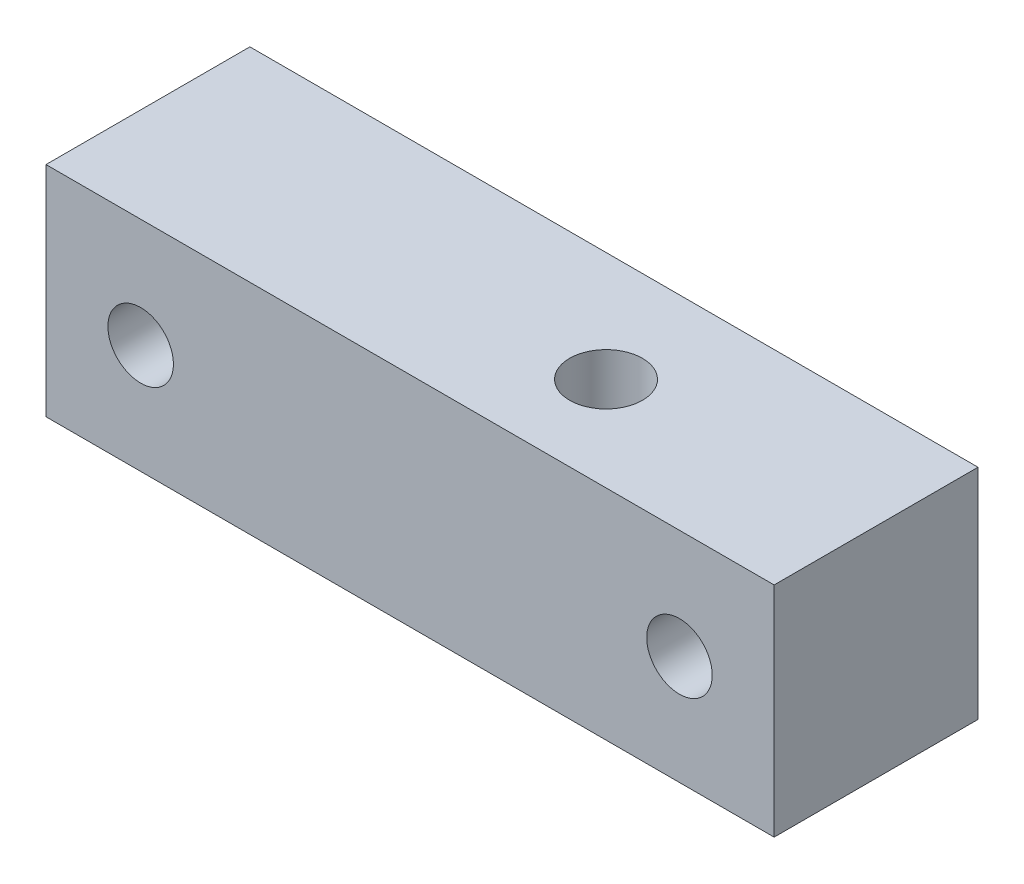
ISO-10303-21;
HEADER;
FILE_DESCRIPTION(('STEP AP214'),'2;1');
FILE_NAME('part.step','',(''),(''),'','','');
FILE_SCHEMA(('AUTOMOTIVE_DESIGN { 1 0 10303 214 1 1 1 1 }'));
ENDSEC;
DATA;
#1=APPLICATION_CONTEXT('core data for automotive mechanical design processes');
#2=APPLICATION_PROTOCOL_DEFINITION('international standard','automotive_design',2000,#1);
#3=PRODUCT_CONTEXT('',#1,'mechanical');
#4=PRODUCT('Part','Part','',(#3));
#5=PRODUCT_RELATED_PRODUCT_CATEGORY('part','',(#4));
#6=PRODUCT_DEFINITION_FORMATION('','',#4);
#7=PRODUCT_DEFINITION_CONTEXT('part definition',#1,'design');
#8=PRODUCT_DEFINITION('design','',#6,#7);
#9=PRODUCT_DEFINITION_SHAPE('','',#8);
#10=(LENGTH_UNIT() NAMED_UNIT(*) SI_UNIT(.MILLI.,.METRE.));
#11=(NAMED_UNIT(*) PLANE_ANGLE_UNIT() SI_UNIT($,.RADIAN.));
#12=(NAMED_UNIT(*) SI_UNIT($,.STERADIAN.) SOLID_ANGLE_UNIT());
#13=UNCERTAINTY_MEASURE_WITH_UNIT(LENGTH_MEASURE(1.E-05),#10,'distance_accuracy_value','');
#14=(GEOMETRIC_REPRESENTATION_CONTEXT(3) GLOBAL_UNCERTAINTY_ASSIGNED_CONTEXT((#13)) GLOBAL_UNIT_ASSIGNED_CONTEXT((#10,
#11,#12)) REPRESENTATION_CONTEXT('',''));
#15=CARTESIAN_POINT('',(0.,0.,0.));
#16=DIRECTION('',(0.,0.,1.));
#17=DIRECTION('',(1.,0.,0.));
#18=AXIS2_PLACEMENT_3D('',#15,#16,#17);
#19=CARTESIAN_POINT('',(0.,15.,14.));
#20=DIRECTION('',(1.,0.,0.));
#21=DIRECTION('',(0.,0.,-1.));
#22=AXIS2_PLACEMENT_3D('',#19,#20,#21);
#23=PLANE('',#22);
#24=DIRECTION('',(0.,-1.,0.));
#25=VECTOR('',#24,1.);
#26=CARTESIAN_POINT('',(0.,15.,0.));
#27=LINE('',#26,#25);
#28=CARTESIAN_POINT('',(0.,15.,0.));
#29=VERTEX_POINT('',#28);
#30=CARTESIAN_POINT('',(0.,0.,0.));
#31=VERTEX_POINT('',#30);
#32=EDGE_CURVE('E96',#29,#31,#27,.T.);
#33=ORIENTED_EDGE('',*,*,#32,.T.);
#34=DIRECTION('',(0.,0.,-1.));
#35=VECTOR('',#34,1.);
#36=CARTESIAN_POINT('',(0.,0.,14.));
#37=LINE('',#36,#35);
#38=CARTESIAN_POINT('',(0.,0.,14.));
#39=VERTEX_POINT('',#38);
#40=EDGE_CURVE('E11',#39,#31,#37,.T.);
#41=ORIENTED_EDGE('',*,*,#40,.F.);
#42=DIRECTION('',(0.,-1.,0.));
#43=VECTOR('',#42,1.);
#44=CARTESIAN_POINT('',(0.,15.,14.));
#45=LINE('',#44,#43);
#46=CARTESIAN_POINT('',(0.,15.,14.));
#47=VERTEX_POINT('',#46);
#48=EDGE_CURVE('E84',#47,#39,#45,.T.);
#49=ORIENTED_EDGE('',*,*,#48,.F.);
#50=DIRECTION('',(0.,0.,-1.));
#51=VECTOR('',#50,1.);
#52=CARTESIAN_POINT('',(0.,15.,14.));
#53=LINE('',#52,#51);
#54=EDGE_CURVE('E92',#47,#29,#53,.T.);
#55=ORIENTED_EDGE('',*,*,#54,.T.);
#56=EDGE_LOOP('',(#33,#41,#49,#55));
#57=FACE_BOUND('',#56,.T.);
#58=ADVANCED_FACE('F33',(#57),#23,.F.);
#59=CARTESIAN_POINT('',(0.,0.,14.));
#60=DIRECTION('',(0.,1.,0.));
#61=DIRECTION('',(0.,0.,1.));
#62=AXIS2_PLACEMENT_3D('',#59,#60,#61);
#63=PLANE('',#62);
#64=CARTESIAN_POINT('',(32.,0.,7.54199160164415));
#65=DIRECTION('',(0.,1.,0.));
#66=DIRECTION('',(-1.,0.,0.));
#67=AXIS2_PLACEMENT_3D('',#64,#65,#66);
#68=CIRCLE('',#67,2.5);
#69=CARTESIAN_POINT('',(29.5,0.,7.54199160164415));
#70=VERTEX_POINT('',#69);
#71=EDGE_CURVE('E99',#70,#70,#68,.T.);
#72=ORIENTED_EDGE('',*,*,#71,.T.);
#73=EDGE_LOOP('',(#72));
#74=FACE_BOUND('',#73,.T.);
#75=DIRECTION('',(1.,0.,0.));
#76=VECTOR('',#75,1.);
#77=CARTESIAN_POINT('',(0.,0.,0.));
#78=LINE('',#77,#76);
#79=CARTESIAN_POINT('',(50.,0.,0.));
#80=VERTEX_POINT('',#79);
#81=EDGE_CURVE('E88',#31,#80,#78,.T.);
#82=ORIENTED_EDGE('',*,*,#81,.T.);
#83=DIRECTION('',(0.,0.,-1.));
#84=VECTOR('',#83,1.);
#85=CARTESIAN_POINT('',(50.,0.,14.));
#86=LINE('',#85,#84);
#87=CARTESIAN_POINT('',(50.,0.,14.));
#88=VERTEX_POINT('',#87);
#89=EDGE_CURVE('E41',#88,#80,#86,.T.);
#90=ORIENTED_EDGE('',*,*,#89,.F.);
#91=DIRECTION('',(1.,0.,0.));
#92=VECTOR('',#91,1.);
#93=CARTESIAN_POINT('',(0.,0.,14.));
#94=LINE('',#93,#92);
#95=EDGE_CURVE('E79',#39,#88,#94,.T.);
#96=ORIENTED_EDGE('',*,*,#95,.F.);
#97=ORIENTED_EDGE('',*,*,#40,.T.);
#98=EDGE_LOOP('',(#82,#90,#96,#97));
#99=FACE_BOUND('',#98,.T.);
#100=ADVANCED_FACE('F87',(#74,#99),#63,.F.);
#101=CARTESIAN_POINT('',(50.,0.,14.));
#102=DIRECTION('',(-1.,0.,0.));
#103=DIRECTION('',(0.,0.,1.));
#104=AXIS2_PLACEMENT_3D('',#101,#102,#103);
#105=PLANE('',#104);
#106=DIRECTION('',(0.,1.,0.));
#107=VECTOR('',#106,1.);
#108=CARTESIAN_POINT('',(50.,0.,0.));
#109=LINE('',#108,#107);
#110=CARTESIAN_POINT('',(50.,15.,0.));
#111=VERTEX_POINT('',#110);
#112=EDGE_CURVE('E66',#80,#111,#109,.T.);
#113=ORIENTED_EDGE('',*,*,#112,.T.);
#114=DIRECTION('',(0.,0.,-1.));
#115=VECTOR('',#114,1.);
#116=CARTESIAN_POINT('',(50.,15.,14.));
#117=LINE('',#116,#115);
#118=CARTESIAN_POINT('',(50.,15.,14.));
#119=VERTEX_POINT('',#118);
#120=EDGE_CURVE('E89',#119,#111,#117,.T.);
#121=ORIENTED_EDGE('',*,*,#120,.F.);
#122=DIRECTION('',(0.,1.,0.));
#123=VECTOR('',#122,1.);
#124=CARTESIAN_POINT('',(50.,0.,14.));
#125=LINE('',#124,#123);
#126=EDGE_CURVE('E82',#88,#119,#125,.T.);
#127=ORIENTED_EDGE('',*,*,#126,.F.);
#128=ORIENTED_EDGE('',*,*,#89,.T.);
#129=EDGE_LOOP('',(#113,#121,#127,#128));
#130=FACE_BOUND('',#129,.T.);
#131=ADVANCED_FACE('F90',(#130),#105,.F.);
#132=CARTESIAN_POINT('',(50.,15.,14.));
#133=DIRECTION('',(0.,-1.,0.));
#134=DIRECTION('',(1.,0.,0.));
#135=AXIS2_PLACEMENT_3D('',#132,#133,#134);
#136=PLANE('',#135);
#137=CARTESIAN_POINT('',(32.,15.,7.54199160164415));
#138=DIRECTION('',(0.,1.,0.));
#139=DIRECTION('',(-1.,0.,0.));
#140=AXIS2_PLACEMENT_3D('',#137,#138,#139);
#141=CIRCLE('',#140,2.5);
#142=CARTESIAN_POINT('',(29.5,15.,7.54199160164415));
#143=VERTEX_POINT('',#142);
#144=EDGE_CURVE('E110',#143,#143,#141,.T.);
#145=ORIENTED_EDGE('',*,*,#144,.F.);
#146=EDGE_LOOP('',(#145));
#147=FACE_BOUND('',#146,.T.);
#148=DIRECTION('',(-1.,0.,0.));
#149=VECTOR('',#148,1.);
#150=CARTESIAN_POINT('',(50.,15.,0.));
#151=LINE('',#150,#149);
#152=EDGE_CURVE('E72',#111,#29,#151,.T.);
#153=ORIENTED_EDGE('',*,*,#152,.T.);
#154=ORIENTED_EDGE('',*,*,#54,.F.);
#155=DIRECTION('',(-1.,0.,0.));
#156=VECTOR('',#155,1.);
#157=CARTESIAN_POINT('',(50.,15.,14.));
#158=LINE('',#157,#156);
#159=EDGE_CURVE('E49',#119,#47,#158,.T.);
#160=ORIENTED_EDGE('',*,*,#159,.F.);
#161=ORIENTED_EDGE('',*,*,#120,.T.);
#162=EDGE_LOOP('',(#153,#154,#160,#161));
#163=FACE_BOUND('',#162,.T.);
#164=ADVANCED_FACE('F104',(#147,#163),#136,.F.);
#165=CARTESIAN_POINT('',(0.,0.,14.));
#166=DIRECTION('',(0.,0.,1.));
#167=DIRECTION('',(1.,0.,0.));
#168=AXIS2_PLACEMENT_3D('',#165,#166,#167);
#169=PLANE('',#168);
#170=CARTESIAN_POINT('',(43.5,7.5,14.));
#171=DIRECTION('',(0.,0.,1.));
#172=DIRECTION('',(1.,0.,0.));
#173=AXIS2_PLACEMENT_3D('',#170,#171,#172);
#174=CIRCLE('',#173,2.25);
#175=CARTESIAN_POINT('',(45.75,7.5,14.));
#176=VERTEX_POINT('',#175);
#177=EDGE_CURVE('E122',#176,#176,#174,.T.);
#178=ORIENTED_EDGE('',*,*,#177,.F.);
#179=EDGE_LOOP('',(#178));
#180=FACE_BOUND('',#179,.T.);
#181=CARTESIAN_POINT('',(6.5,7.5,14.));
#182=DIRECTION('',(0.,0.,1.));
#183=DIRECTION('',(1.,0.,0.));
#184=AXIS2_PLACEMENT_3D('',#181,#182,#183);
#185=CIRCLE('',#184,2.25);
#186=CARTESIAN_POINT('',(8.75,7.5,14.));
#187=VERTEX_POINT('',#186);
#188=EDGE_CURVE('E116',#187,#187,#185,.T.);
#189=ORIENTED_EDGE('',*,*,#188,.F.);
#190=EDGE_LOOP('',(#189));
#191=FACE_BOUND('',#190,.T.);
#192=ORIENTED_EDGE('',*,*,#48,.T.);
#193=ORIENTED_EDGE('',*,*,#95,.T.);
#194=ORIENTED_EDGE('',*,*,#126,.T.);
#195=ORIENTED_EDGE('',*,*,#159,.T.);
#196=EDGE_LOOP('',(#192,#193,#194,#195));
#197=FACE_BOUND('',#196,.T.);
#198=ADVANCED_FACE('F80',(#180,#191,#197),#169,.T.);
#199=CARTESIAN_POINT('',(0.,0.,0.));
#200=DIRECTION('',(0.,0.,1.));
#201=DIRECTION('',(1.,0.,0.));
#202=AXIS2_PLACEMENT_3D('',#199,#200,#201);
#203=PLANE('',#202);
#204=CARTESIAN_POINT('',(43.5,7.5,0.));
#205=DIRECTION('',(0.,0.,1.));
#206=DIRECTION('',(1.,0.,0.));
#207=AXIS2_PLACEMENT_3D('',#204,#205,#206);
#208=CIRCLE('',#207,2.25);
#209=CARTESIAN_POINT('',(45.75,7.5,0.));
#210=VERTEX_POINT('',#209);
#211=EDGE_CURVE('E119',#210,#210,#208,.T.);
#212=ORIENTED_EDGE('',*,*,#211,.T.);
#213=EDGE_LOOP('',(#212));
#214=FACE_BOUND('',#213,.T.);
#215=CARTESIAN_POINT('',(6.5,7.5,0.));
#216=DIRECTION('',(0.,0.,1.));
#217=DIRECTION('',(1.,0.,0.));
#218=AXIS2_PLACEMENT_3D('',#215,#216,#217);
#219=CIRCLE('',#218,2.25);
#220=CARTESIAN_POINT('',(8.75,7.5,0.));
#221=VERTEX_POINT('',#220);
#222=EDGE_CURVE('E113',#221,#221,#219,.T.);
#223=ORIENTED_EDGE('',*,*,#222,.T.);
#224=EDGE_LOOP('',(#223));
#225=FACE_BOUND('',#224,.T.);
#226=ORIENTED_EDGE('',*,*,#32,.F.);
#227=ORIENTED_EDGE('',*,*,#152,.F.);
#228=ORIENTED_EDGE('',*,*,#112,.F.);
#229=ORIENTED_EDGE('',*,*,#81,.F.);
#230=EDGE_LOOP('',(#226,#227,#228,#229));
#231=FACE_BOUND('',#230,.T.);
#232=ADVANCED_FACE('F107',(#214,#225,#231),#203,.F.);
#233=CARTESIAN_POINT('',(32.,0.,7.54199160164415));
#234=DIRECTION('',(0.,1.,0.));
#235=DIRECTION('',(-1.,0.,0.));
#236=AXIS2_PLACEMENT_3D('',#233,#234,#235);
#237=CYLINDRICAL_SURFACE('',#236,2.5);
#238=ORIENTED_EDGE('',*,*,#71,.F.);
#239=EDGE_LOOP('',(#238));
#240=FACE_BOUND('',#239,.T.);
#241=ORIENTED_EDGE('',*,*,#144,.T.);
#242=EDGE_LOOP('',(#241));
#243=FACE_BOUND('',#242,.T.);
#244=ADVANCED_FACE('F143',(#240,#243),#237,.F.);
#245=CARTESIAN_POINT('',(6.5,7.5,0.));
#246=DIRECTION('',(0.,0.,1.));
#247=DIRECTION('',(1.,0.,0.));
#248=AXIS2_PLACEMENT_3D('',#245,#246,#247);
#249=CYLINDRICAL_SURFACE('',#248,2.25);
#250=ORIENTED_EDGE('',*,*,#222,.F.);
#251=EDGE_LOOP('',(#250));
#252=FACE_BOUND('',#251,.T.);
#253=ORIENTED_EDGE('',*,*,#188,.T.);
#254=EDGE_LOOP('',(#253));
#255=FACE_BOUND('',#254,.T.);
#256=ADVANCED_FACE('F133',(#252,#255),#249,.F.);
#257=CARTESIAN_POINT('',(43.5,7.5,0.));
#258=DIRECTION('',(0.,0.,1.));
#259=DIRECTION('',(1.,0.,0.));
#260=AXIS2_PLACEMENT_3D('',#257,#258,#259);
#261=CYLINDRICAL_SURFACE('',#260,2.25);
#262=ORIENTED_EDGE('',*,*,#211,.F.);
#263=EDGE_LOOP('',(#262));
#264=FACE_BOUND('',#263,.T.);
#265=ORIENTED_EDGE('',*,*,#177,.T.);
#266=EDGE_LOOP('',(#265));
#267=FACE_BOUND('',#266,.T.);
#268=ADVANCED_FACE('F130',(#264,#267),#261,.F.);
#269=CLOSED_SHELL('',(#58,#100,#131,#164,#198,#232,#244,#256,#268));
#270=MANIFOLD_SOLID_BREP('B2',#269);
#271=ADVANCED_BREP_SHAPE_REPRESENTATION('',(#18,#270),#14);
#272=SHAPE_DEFINITION_REPRESENTATION(#9,#271);
ENDSEC;
END-ISO-10303-21;
